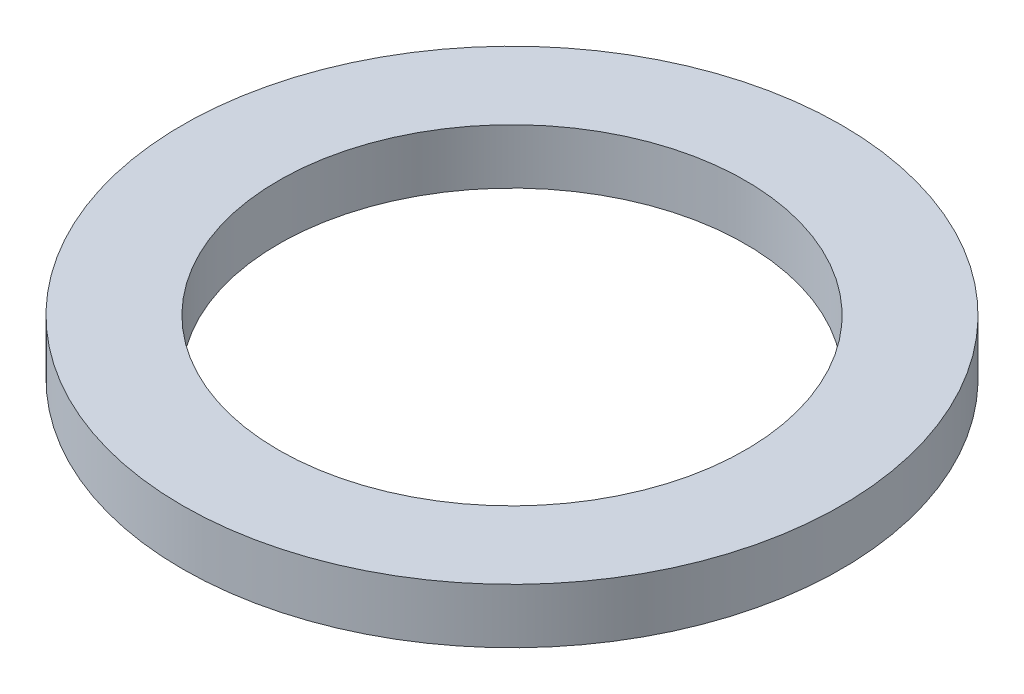
ISO-10303-21;
HEADER;
FILE_DESCRIPTION(('STEP AP214'),'2;1');
FILE_NAME('part.step','',(''),(''),'','','');
FILE_SCHEMA(('AUTOMOTIVE_DESIGN { 1 0 10303 214 1 1 1 1 }'));
ENDSEC;
DATA;
#1=APPLICATION_CONTEXT('core data for automotive mechanical design processes');
#2=APPLICATION_PROTOCOL_DEFINITION('international standard','automotive_design',2000,#1);
#3=PRODUCT_CONTEXT('',#1,'mechanical');
#4=PRODUCT('Part','Part','',(#3));
#5=PRODUCT_RELATED_PRODUCT_CATEGORY('part','',(#4));
#6=PRODUCT_DEFINITION_FORMATION('','',#4);
#7=PRODUCT_DEFINITION_CONTEXT('part definition',#1,'design');
#8=PRODUCT_DEFINITION('design','',#6,#7);
#9=PRODUCT_DEFINITION_SHAPE('','',#8);
#10=(LENGTH_UNIT() NAMED_UNIT(*) SI_UNIT(.MILLI.,.METRE.));
#11=(NAMED_UNIT(*) PLANE_ANGLE_UNIT() SI_UNIT($,.RADIAN.));
#12=(NAMED_UNIT(*) SI_UNIT($,.STERADIAN.) SOLID_ANGLE_UNIT());
#13=UNCERTAINTY_MEASURE_WITH_UNIT(LENGTH_MEASURE(1.E-05),#10,'distance_accuracy_value','');
#14=(GEOMETRIC_REPRESENTATION_CONTEXT(3) GLOBAL_UNCERTAINTY_ASSIGNED_CONTEXT((#13)) GLOBAL_UNIT_ASSIGNED_CONTEXT((#10,
#11,#12)) REPRESENTATION_CONTEXT('',''));
#15=CARTESIAN_POINT('',(0.,0.,0.));
#16=DIRECTION('',(0.,0.,1.));
#17=DIRECTION('',(1.,0.,0.));
#18=AXIS2_PLACEMENT_3D('',#15,#16,#17);
#19=CARTESIAN_POINT('',(0.,10.,0.));
#20=DIRECTION('',(0.,-1.,0.));
#21=DIRECTION('',(0.,0.,-1.));
#22=AXIS2_PLACEMENT_3D('',#19,#20,#21);
#23=CYLINDRICAL_SURFACE('',#22,60.);
#24=CARTESIAN_POINT('',(0.,10.,0.));
#25=DIRECTION('',(0.,1.,0.));
#26=DIRECTION('',(0.,0.,1.));
#27=AXIS2_PLACEMENT_3D('',#24,#25,#26);
#28=CIRCLE('',#27,60.);
#29=CARTESIAN_POINT('',(0.,10.,60.));
#30=VERTEX_POINT('',#29);
#31=EDGE_CURVE('E10',#30,#30,#28,.T.);
#32=ORIENTED_EDGE('',*,*,#31,.F.);
#33=EDGE_LOOP('',(#32));
#34=FACE_BOUND('',#33,.T.);
#35=CARTESIAN_POINT('',(0.,0.,0.));
#36=DIRECTION('',(0.,1.,0.));
#37=DIRECTION('',(0.,0.,1.));
#38=AXIS2_PLACEMENT_3D('',#35,#36,#37);
#39=CIRCLE('',#38,60.);
#40=CARTESIAN_POINT('',(0.,0.,60.));
#41=VERTEX_POINT('',#40);
#42=EDGE_CURVE('E37',#41,#41,#39,.T.);
#43=ORIENTED_EDGE('',*,*,#42,.T.);
#44=EDGE_LOOP('',(#43));
#45=FACE_BOUND('',#44,.T.);
#46=ADVANCED_FACE('F40',(#34,#45),#23,.T.);
#47=CARTESIAN_POINT('',(0.,10.,0.));
#48=DIRECTION('',(0.,1.,0.));
#49=DIRECTION('',(0.,0.,1.));
#50=AXIS2_PLACEMENT_3D('',#47,#48,#49);
#51=PLANE('',#50);
#52=CARTESIAN_POINT('',(0.,10.,0.));
#53=DIRECTION('',(0.,1.,0.));
#54=DIRECTION('',(0.,0.,1.));
#55=AXIS2_PLACEMENT_3D('',#52,#53,#54);
#56=CIRCLE('',#55,42.5);
#57=CARTESIAN_POINT('',(0.,10.,42.5));
#58=VERTEX_POINT('',#57);
#59=EDGE_CURVE('E50',#58,#58,#56,.T.);
#60=ORIENTED_EDGE('',*,*,#59,.F.);
#61=EDGE_LOOP('',(#60));
#62=FACE_BOUND('',#61,.T.);
#63=ORIENTED_EDGE('',*,*,#31,.T.);
#64=EDGE_LOOP('',(#63));
#65=FACE_BOUND('',#64,.T.);
#66=ADVANCED_FACE('F59',(#62,#65),#51,.T.);
#67=CARTESIAN_POINT('',(0.,0.,0.));
#68=DIRECTION('',(0.,1.,0.));
#69=DIRECTION('',(0.,0.,1.));
#70=AXIS2_PLACEMENT_3D('',#67,#68,#69);
#71=PLANE('',#70);
#72=CARTESIAN_POINT('',(0.,0.,0.));
#73=DIRECTION('',(0.,1.,0.));
#74=DIRECTION('',(0.,0.,1.));
#75=AXIS2_PLACEMENT_3D('',#72,#73,#74);
#76=CIRCLE('',#75,42.5);
#77=CARTESIAN_POINT('',(0.,0.,42.5));
#78=VERTEX_POINT('',#77);
#79=EDGE_CURVE('E47',#78,#78,#76,.T.);
#80=ORIENTED_EDGE('',*,*,#79,.T.);
#81=EDGE_LOOP('',(#80));
#82=FACE_BOUND('',#81,.T.);
#83=ORIENTED_EDGE('',*,*,#42,.F.);
#84=EDGE_LOOP('',(#83));
#85=FACE_BOUND('',#84,.T.);
#86=ADVANCED_FACE('F58',(#82,#85),#71,.F.);
#87=CARTESIAN_POINT('',(0.,10.,0.));
#88=DIRECTION('',(0.,-1.,0.));
#89=DIRECTION('',(0.,0.,-1.));
#90=AXIS2_PLACEMENT_3D('',#87,#88,#89);
#91=CYLINDRICAL_SURFACE('',#90,42.5);
#92=ORIENTED_EDGE('',*,*,#59,.T.);
#93=EDGE_LOOP('',(#92));
#94=FACE_BOUND('',#93,.T.);
#95=ORIENTED_EDGE('',*,*,#79,.F.);
#96=EDGE_LOOP('',(#95));
#97=FACE_BOUND('',#96,.T.);
#98=ADVANCED_FACE('F54',(#94,#97),#91,.F.);
#99=CLOSED_SHELL('',(#46,#66,#86,#98));
#100=MANIFOLD_SOLID_BREP('B2',#99);
#101=ADVANCED_BREP_SHAPE_REPRESENTATION('',(#18,#100),#14);
#102=SHAPE_DEFINITION_REPRESENTATION(#9,#101);
ENDSEC;
END-ISO-10303-21;
